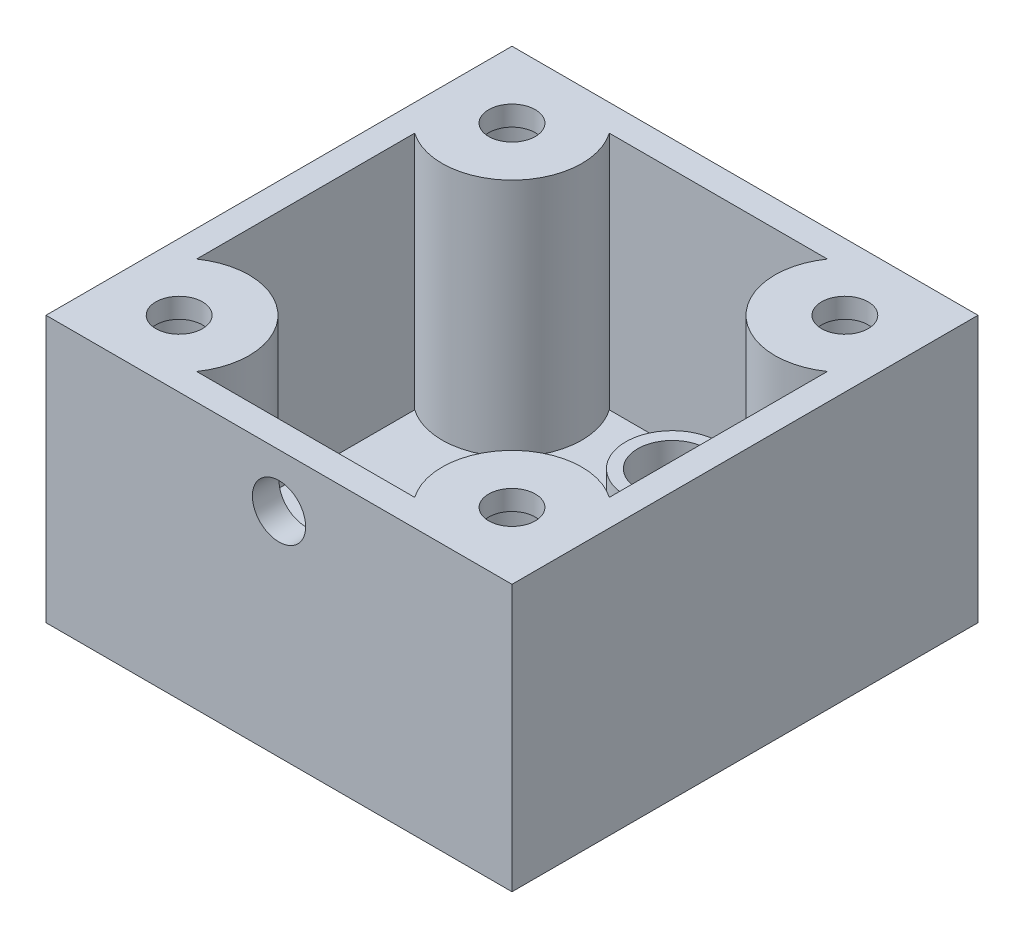
ISO-10303-21;
HEADER;
FILE_DESCRIPTION(('STEP AP214'),'2;1');
FILE_NAME('part.step','',(''),(''),'','','');
FILE_SCHEMA(('AUTOMOTIVE_DESIGN { 1 0 10303 214 1 1 1 1 }'));
ENDSEC;
DATA;
#1=APPLICATION_CONTEXT('core data for automotive mechanical design processes');
#2=APPLICATION_PROTOCOL_DEFINITION('international standard','automotive_design',2000,#1);
#3=PRODUCT_CONTEXT('',#1,'mechanical');
#4=PRODUCT('Part','Part','',(#3));
#5=PRODUCT_RELATED_PRODUCT_CATEGORY('part','',(#4));
#6=PRODUCT_DEFINITION_FORMATION('','',#4);
#7=PRODUCT_DEFINITION_CONTEXT('part definition',#1,'design');
#8=PRODUCT_DEFINITION('design','',#6,#7);
#9=PRODUCT_DEFINITION_SHAPE('','',#8);
#10=(LENGTH_UNIT() NAMED_UNIT(*) SI_UNIT(.MILLI.,.METRE.));
#11=(NAMED_UNIT(*) PLANE_ANGLE_UNIT() SI_UNIT($,.RADIAN.));
#12=(NAMED_UNIT(*) SI_UNIT($,.STERADIAN.) SOLID_ANGLE_UNIT());
#13=UNCERTAINTY_MEASURE_WITH_UNIT(LENGTH_MEASURE(1.E-05),#10,'distance_accuracy_value','');
#14=(GEOMETRIC_REPRESENTATION_CONTEXT(3) GLOBAL_UNCERTAINTY_ASSIGNED_CONTEXT((#13)) GLOBAL_UNIT_ASSIGNED_CONTEXT((#10,
#11,#12)) REPRESENTATION_CONTEXT('',''));
#15=CARTESIAN_POINT('',(0.,0.,0.));
#16=DIRECTION('',(0.,0.,1.));
#17=DIRECTION('',(1.,0.,0.));
#18=AXIS2_PLACEMENT_3D('',#15,#16,#17);
#19=CARTESIAN_POINT('',(-8.19157801509647,-63.8406204335661,-15.5));
#20=DIRECTION('',(0.,0.,-1.));
#21=DIRECTION('',(-1.,0.,0.));
#22=AXIS2_PLACEMENT_3D('',#19,#20,#21);
#23=PLANE('',#22);
#24=DIRECTION('',(0.,-1.,0.));
#25=VECTOR('',#24,1.);
#26=CARTESIAN_POINT('',(0.532816501638932,-16.,-15.5));
#27=LINE('',#26,#25);
#28=CARTESIAN_POINT('',(0.532816501638932,-18.,-15.5));
#29=VERTEX_POINT('',#28);
#30=CARTESIAN_POINT('',(0.532816501638932,-16.,-15.5));
#31=VERTEX_POINT('',#30);
#32=EDGE_CURVE('E12',#29,#31,#27,.F.);
#33=ORIENTED_EDGE('',*,*,#32,.F.);
#34=DIRECTION('',(-1.,0.,0.));
#35=VECTOR('',#34,1.);
#36=CARTESIAN_POINT('',(-8.19157801509647,-18.,-15.5));
#37=LINE('',#36,#35);
#38=CARTESIAN_POINT('',(8.19157801509653,-18.,-15.5));
#39=VERTEX_POINT('',#38);
#40=EDGE_CURVE('E228',#39,#29,#37,.T.);
#41=ORIENTED_EDGE('',*,*,#40,.F.);
#42=DIRECTION('',(0.,1.,0.));
#43=VECTOR('',#42,1.);
#44=CARTESIAN_POINT('',(8.19157801509653,-63.8406204335661,-15.5));
#45=LINE('',#44,#43);
#46=CARTESIAN_POINT('',(8.19157801509653,0.,-15.5));
#47=VERTEX_POINT('',#46);
#48=EDGE_CURVE('E235',#39,#47,#45,.T.);
#49=ORIENTED_EDGE('',*,*,#48,.T.);
#50=DIRECTION('',(-1.,0.,0.));
#51=VECTOR('',#50,1.);
#52=CARTESIAN_POINT('',(-8.19157801509647,0.,-15.5));
#53=LINE('',#52,#51);
#54=CARTESIAN_POINT('',(-8.19157801509647,0.,-15.5));
#55=VERTEX_POINT('',#54);
#56=EDGE_CURVE('E197',#47,#55,#53,.T.);
#57=ORIENTED_EDGE('',*,*,#56,.T.);
#58=DIRECTION('',(0.,1.,0.));
#59=VECTOR('',#58,1.);
#60=CARTESIAN_POINT('',(-8.19157801509647,-63.8406204335661,-15.5));
#61=LINE('',#60,#59);
#62=CARTESIAN_POINT('',(-8.19157801509647,-18.,-15.5));
#63=VERTEX_POINT('',#62);
#64=EDGE_CURVE('E227',#63,#55,#61,.T.);
#65=ORIENTED_EDGE('',*,*,#64,.F.);
#66=CARTESIAN_POINT('',(-0.532816501638932,-18.,-15.5));
#67=VERTEX_POINT('',#66);
#68=EDGE_CURVE('E231',#67,#63,#37,.T.);
#69=ORIENTED_EDGE('',*,*,#68,.F.);
#70=DIRECTION('',(0.,-1.,0.));
#71=VECTOR('',#70,1.);
#72=CARTESIAN_POINT('',(-0.532816501638932,-16.,-15.5));
#73=LINE('',#72,#71);
#74=CARTESIAN_POINT('',(-0.532816501638932,-16.,-15.5));
#75=VERTEX_POINT('',#74);
#76=EDGE_CURVE('E312',#75,#67,#73,.T.);
#77=ORIENTED_EDGE('',*,*,#76,.F.);
#78=DIRECTION('',(1.,0.,0.));
#79=VECTOR('',#78,1.);
#80=CARTESIAN_POINT('',(-8.19157801509647,-16.,-15.5));
#81=LINE('',#80,#79);
#82=EDGE_CURVE('E47',#75,#31,#81,.T.);
#83=ORIENTED_EDGE('',*,*,#82,.T.);
#84=EDGE_LOOP('',(#33,#41,#49,#57,#65,#69,#77,#83));
#85=FACE_BOUND('',#84,.T.);
#86=ADVANCED_FACE('F38',(#85),#23,.F.);
#87=CARTESIAN_POINT('',(0.,0.,0.));
#88=DIRECTION('',(0.,-1.,0.));
#89=DIRECTION('',(0.,0.,-1.));
#90=AXIS2_PLACEMENT_3D('',#87,#88,#89);
#91=PLANE('',#90);
#92=CARTESIAN_POINT('',(-12.4999999999993,0.,12.5));
#93=DIRECTION('',(0.,1.,0.));
#94=DIRECTION('',(0.,0.,1.));
#95=AXIS2_PLACEMENT_3D('',#92,#93,#94);
#96=CIRCLE('',#95,1.75000000000037);
#97=CARTESIAN_POINT('',(-12.4999999999993,0.,14.2500000000004));
#98=VERTEX_POINT('',#97);
#99=EDGE_CURVE('E181',#98,#98,#96,.T.);
#100=ORIENTED_EDGE('',*,*,#99,.F.);
#101=EDGE_LOOP('',(#100));
#102=FACE_BOUND('',#101,.T.);
#103=CARTESIAN_POINT('',(12.5000000000007,0.,12.4999999999993));
#104=DIRECTION('',(0.,1.,0.));
#105=DIRECTION('',(0.,0.,1.));
#106=AXIS2_PLACEMENT_3D('',#103,#104,#105);
#107=CIRCLE('',#106,1.750000000001);
#108=CARTESIAN_POINT('',(12.5000000000007,0.,14.2500000000003));
#109=VERTEX_POINT('',#108);
#110=EDGE_CURVE('E178',#109,#109,#107,.T.);
#111=ORIENTED_EDGE('',*,*,#110,.F.);
#112=EDGE_LOOP('',(#111));
#113=FACE_BOUND('',#112,.T.);
#114=CARTESIAN_POINT('',(12.5,0.,-12.5000000000007));
#115=DIRECTION('',(0.,1.,0.));
#116=DIRECTION('',(0.,0.,1.));
#117=AXIS2_PLACEMENT_3D('',#114,#115,#116);
#118=CIRCLE('',#117,1.75000000000073);
#119=CARTESIAN_POINT('',(12.5,0.,-10.75));
#120=VERTEX_POINT('',#119);
#121=EDGE_CURVE('E174',#120,#120,#118,.T.);
#122=ORIENTED_EDGE('',*,*,#121,.F.);
#123=EDGE_LOOP('',(#122));
#124=FACE_BOUND('',#123,.T.);
#125=CARTESIAN_POINT('',(-12.5,0.,-12.5));
#126=DIRECTION('',(0.,1.,0.));
#127=DIRECTION('',(0.,0.,1.));
#128=AXIS2_PLACEMENT_3D('',#125,#126,#127);
#129=CIRCLE('',#128,1.75);
#130=CARTESIAN_POINT('',(-12.5,0.,-10.75));
#131=VERTEX_POINT('',#130);
#132=EDGE_CURVE('E177',#131,#131,#129,.T.);
#133=ORIENTED_EDGE('',*,*,#132,.F.);
#134=EDGE_LOOP('',(#133));
#135=FACE_BOUND('',#134,.T.);
#136=DIRECTION('',(0.,0.,-1.));
#137=VECTOR('',#136,1.);
#138=CARTESIAN_POINT('',(17.5,0.,17.5));
#139=LINE('',#138,#137);
#140=CARTESIAN_POINT('',(17.5,0.,17.5));
#141=VERTEX_POINT('',#140);
#142=CARTESIAN_POINT('',(17.5,0.,-17.5));
#143=VERTEX_POINT('',#142);
#144=EDGE_CURVE('E283',#141,#143,#139,.T.);
#145=ORIENTED_EDGE('',*,*,#144,.T.);
#146=DIRECTION('',(-1.,0.,0.));
#147=VECTOR('',#146,1.);
#148=CARTESIAN_POINT('',(-17.5,0.,-17.5));
#149=LINE('',#148,#147);
#150=CARTESIAN_POINT('',(-17.5,0.,-17.5));
#151=VERTEX_POINT('',#150);
#152=EDGE_CURVE('E302',#143,#151,#149,.T.);
#153=ORIENTED_EDGE('',*,*,#152,.T.);
#154=DIRECTION('',(0.,0.,1.));
#155=VECTOR('',#154,1.);
#156=CARTESIAN_POINT('',(-17.5,0.,17.5));
#157=LINE('',#156,#155);
#158=CARTESIAN_POINT('',(-17.5,0.,17.5));
#159=VERTEX_POINT('',#158);
#160=EDGE_CURVE('E305',#151,#159,#157,.T.);
#161=ORIENTED_EDGE('',*,*,#160,.T.);
#162=DIRECTION('',(1.,0.,0.));
#163=VECTOR('',#162,1.);
#164=CARTESIAN_POINT('',(-17.5,0.,17.5));
#165=LINE('',#164,#163);
#166=EDGE_CURVE('E290',#159,#141,#165,.T.);
#167=ORIENTED_EDGE('',*,*,#166,.T.);
#168=EDGE_LOOP('',(#145,#153,#161,#167));
#169=FACE_BOUND('',#168,.T.);
#170=CARTESIAN_POINT('',(-12.5000000000001,0.,12.4999999999999));
#171=DIRECTION('',(0.,-1.,0.));
#172=DIRECTION('',(0.,0.,-1.));
#173=AXIS2_PLACEMENT_3D('',#170,#171,#172);
#174=CIRCLE('',#173,5.25);
#175=CARTESIAN_POINT('',(-15.5000000000001,0.,8.19157801509631));
#176=VERTEX_POINT('',#175);
#177=CARTESIAN_POINT('',(-8.19157801509664,0.,15.4999999999999));
#178=VERTEX_POINT('',#177);
#179=EDGE_CURVE('E212',#176,#178,#174,.T.);
#180=ORIENTED_EDGE('',*,*,#179,.F.);
#181=DIRECTION('',(0.,0.,1.));
#182=VECTOR('',#181,1.);
#183=CARTESIAN_POINT('',(-15.5000000000001,0.,8.19157801509631));
#184=LINE('',#183,#182);
#185=CARTESIAN_POINT('',(-15.5,0.,-8.19157801509648));
#186=VERTEX_POINT('',#185);
#187=EDGE_CURVE('E215',#186,#176,#184,.T.);
#188=ORIENTED_EDGE('',*,*,#187,.F.);
#189=CARTESIAN_POINT('',(-12.5,0.,-12.5));
#190=DIRECTION('',(0.,-1.,0.));
#191=DIRECTION('',(0.,0.,-1.));
#192=AXIS2_PLACEMENT_3D('',#189,#190,#191);
#193=CIRCLE('',#192,5.25);
#194=EDGE_CURVE('E194',#55,#186,#193,.T.);
#195=ORIENTED_EDGE('',*,*,#194,.F.);
#196=ORIENTED_EDGE('',*,*,#56,.F.);
#197=CARTESIAN_POINT('',(12.5,0.,-12.5));
#198=DIRECTION('',(0.,-1.,0.));
#199=DIRECTION('',(0.,0.,-1.));
#200=AXIS2_PLACEMENT_3D('',#197,#198,#199);
#201=CIRCLE('',#200,5.25);
#202=CARTESIAN_POINT('',(15.5,0.,-8.19157801509642));
#203=VERTEX_POINT('',#202);
#204=EDGE_CURVE('E200',#203,#47,#201,.T.);
#205=ORIENTED_EDGE('',*,*,#204,.F.);
#206=DIRECTION('',(0.,0.,-1.));
#207=VECTOR('',#206,1.);
#208=CARTESIAN_POINT('',(15.5,0.,-8.19157801509642));
#209=LINE('',#208,#207);
#210=CARTESIAN_POINT('',(15.4999999999999,0.,8.19157801509659));
#211=VERTEX_POINT('',#210);
#212=EDGE_CURVE('E203',#211,#203,#209,.T.);
#213=ORIENTED_EDGE('',*,*,#212,.F.);
#214=CARTESIAN_POINT('',(12.4999999999999,0.,12.5000000000001));
#215=DIRECTION('',(0.,-1.,0.));
#216=DIRECTION('',(0.,0.,-1.));
#217=AXIS2_PLACEMENT_3D('',#214,#215,#216);
#218=CIRCLE('',#217,5.25);
#219=CARTESIAN_POINT('',(8.19157801509637,0.,15.5000000000001));
#220=VERTEX_POINT('',#219);
#221=EDGE_CURVE('E206',#220,#211,#218,.T.);
#222=ORIENTED_EDGE('',*,*,#221,.F.);
#223=DIRECTION('',(1.,0.,0.));
#224=VECTOR('',#223,1.);
#225=CARTESIAN_POINT('',(8.19157801509636,0.,15.5000000000001));
#226=LINE('',#225,#224);
#227=EDGE_CURVE('E209',#178,#220,#226,.T.);
#228=ORIENTED_EDGE('',*,*,#227,.F.);
#229=EDGE_LOOP('',(#180,#188,#195,#196,#205,#213,#222,#228));
#230=FACE_BOUND('',#229,.T.);
#231=ADVANCED_FACE('F351',(#102,#113,#124,#135,#169,#230),#91,.F.);
#232=CARTESIAN_POINT('',(17.5,-20.,17.5));
#233=DIRECTION('',(1.,0.,0.));
#234=DIRECTION('',(0.,0.,-1.));
#235=AXIS2_PLACEMENT_3D('',#232,#233,#234);
#236=PLANE('',#235);
#237=ORIENTED_EDGE('',*,*,#144,.F.);
#238=DIRECTION('',(0.,1.,0.));
#239=VECTOR('',#238,1.);
#240=CARTESIAN_POINT('',(17.5,-20.,17.5));
#241=LINE('',#240,#239);
#242=CARTESIAN_POINT('',(17.5,-20.,17.5));
#243=VERTEX_POINT('',#242);
#244=EDGE_CURVE('E310',#243,#141,#241,.T.);
#245=ORIENTED_EDGE('',*,*,#244,.F.);
#246=DIRECTION('',(0.,0.,-1.));
#247=VECTOR('',#246,1.);
#248=CARTESIAN_POINT('',(17.5,-20.,17.5));
#249=LINE('',#248,#247);
#250=CARTESIAN_POINT('',(17.5,-20.,-17.5));
#251=VERTEX_POINT('',#250);
#252=EDGE_CURVE('E286',#243,#251,#249,.T.);
#253=ORIENTED_EDGE('',*,*,#252,.T.);
#254=DIRECTION('',(0.,1.,0.));
#255=VECTOR('',#254,1.);
#256=CARTESIAN_POINT('',(17.5,-20.,-17.5));
#257=LINE('',#256,#255);
#258=EDGE_CURVE('E299',#251,#143,#257,.T.);
#259=ORIENTED_EDGE('',*,*,#258,.T.);
#260=EDGE_LOOP('',(#237,#245,#253,#259));
#261=FACE_BOUND('',#260,.T.);
#262=ADVANCED_FACE('F40',(#261),#236,.T.);
#263=CARTESIAN_POINT('',(-17.5,-20.,17.5));
#264=DIRECTION('',(0.,0.,1.));
#265=DIRECTION('',(1.,0.,0.));
#266=AXIS2_PLACEMENT_3D('',#263,#264,#265);
#267=PLANE('',#266);
#268=CARTESIAN_POINT('',(0.,-4.,17.5));
#269=DIRECTION('',(0.,0.,1.));
#270=DIRECTION('',(1.,0.,0.));
#271=AXIS2_PLACEMENT_3D('',#268,#269,#270);
#272=CIRCLE('',#271,2.);
#273=CARTESIAN_POINT('',(2.,-4.,17.5));
#274=VERTEX_POINT('',#273);
#275=EDGE_CURVE('E670',#274,#274,#272,.T.);
#276=ORIENTED_EDGE('',*,*,#275,.F.);
#277=EDGE_LOOP('',(#276));
#278=FACE_BOUND('',#277,.T.);
#279=ORIENTED_EDGE('',*,*,#166,.F.);
#280=DIRECTION('',(0.,1.,0.));
#281=VECTOR('',#280,1.);
#282=CARTESIAN_POINT('',(-17.5,-20.,17.5));
#283=LINE('',#282,#281);
#284=CARTESIAN_POINT('',(-17.5,-20.,17.5));
#285=VERTEX_POINT('',#284);
#286=EDGE_CURVE('E313',#285,#159,#283,.T.);
#287=ORIENTED_EDGE('',*,*,#286,.F.);
#288=DIRECTION('',(1.,0.,0.));
#289=VECTOR('',#288,1.);
#290=CARTESIAN_POINT('',(-17.5,-20.,17.5));
#291=LINE('',#290,#289);
#292=EDGE_CURVE('E296',#285,#243,#291,.T.);
#293=ORIENTED_EDGE('',*,*,#292,.T.);
#294=ORIENTED_EDGE('',*,*,#244,.T.);
#295=EDGE_LOOP('',(#279,#287,#293,#294));
#296=FACE_BOUND('',#295,.T.);
#297=ADVANCED_FACE('F425',(#278,#296),#267,.T.);
#298=CARTESIAN_POINT('',(-17.5,-20.,17.5));
#299=DIRECTION('',(-1.,0.,0.));
#300=DIRECTION('',(0.,0.,1.));
#301=AXIS2_PLACEMENT_3D('',#298,#299,#300);
#302=PLANE('',#301);
#303=ORIENTED_EDGE('',*,*,#160,.F.);
#304=DIRECTION('',(0.,1.,0.));
#305=VECTOR('',#304,1.);
#306=CARTESIAN_POINT('',(-17.5,-20.,-17.5));
#307=LINE('',#306,#305);
#308=CARTESIAN_POINT('',(-17.5,-20.,-17.5));
#309=VERTEX_POINT('',#308);
#310=EDGE_CURVE('E315',#309,#151,#307,.T.);
#311=ORIENTED_EDGE('',*,*,#310,.F.);
#312=DIRECTION('',(0.,0.,1.));
#313=VECTOR('',#312,1.);
#314=CARTESIAN_POINT('',(-17.5,-20.,17.5));
#315=LINE('',#314,#313);
#316=EDGE_CURVE('E293',#309,#285,#315,.T.);
#317=ORIENTED_EDGE('',*,*,#316,.T.);
#318=ORIENTED_EDGE('',*,*,#286,.T.);
#319=EDGE_LOOP('',(#303,#311,#317,#318));
#320=FACE_BOUND('',#319,.T.);
#321=ADVANCED_FACE('F428',(#320),#302,.T.);
#322=CARTESIAN_POINT('',(-17.5,-20.,-17.5));
#323=DIRECTION('',(0.,0.,-1.));
#324=DIRECTION('',(-1.,0.,0.));
#325=AXIS2_PLACEMENT_3D('',#322,#323,#324);
#326=PLANE('',#325);
#327=ORIENTED_EDGE('',*,*,#152,.F.);
#328=ORIENTED_EDGE('',*,*,#258,.F.);
#329=DIRECTION('',(-1.,0.,0.));
#330=VECTOR('',#329,1.);
#331=CARTESIAN_POINT('',(-17.5,-20.,-17.5));
#332=LINE('',#331,#330);
#333=EDGE_CURVE('E289',#251,#309,#332,.T.);
#334=ORIENTED_EDGE('',*,*,#333,.T.);
#335=ORIENTED_EDGE('',*,*,#310,.T.);
#336=EDGE_LOOP('',(#327,#328,#334,#335));
#337=FACE_BOUND('',#336,.T.);
#338=ADVANCED_FACE('F422',(#337),#326,.T.);
#339=CARTESIAN_POINT('',(0.,-20.,0.));
#340=DIRECTION('',(0.,-1.,0.));
#341=DIRECTION('',(0.,0.,-1.));
#342=AXIS2_PLACEMENT_3D('',#339,#340,#341);
#343=PLANE('',#342);
#344=CARTESIAN_POINT('',(0.,-20.,-12.0407939385487));
#345=DIRECTION('',(0.,1.,0.));
#346=DIRECTION('',(0.,0.,1.));
#347=AXIS2_PLACEMENT_3D('',#344,#345,#346);
#348=CIRCLE('',#347,2.6);
#349=CARTESIAN_POINT('',(0.,-20.,-9.44079393854873));
#350=VERTEX_POINT('',#349);
#351=EDGE_CURVE('E168',#350,#350,#348,.T.);
#352=ORIENTED_EDGE('',*,*,#351,.T.);
#353=EDGE_LOOP('',(#352));
#354=FACE_BOUND('',#353,.T.);
#355=CARTESIAN_POINT('',(0.,-20.,4.5));
#356=DIRECTION('',(0.,1.,0.));
#357=DIRECTION('',(0.,0.,1.));
#358=AXIS2_PLACEMENT_3D('',#355,#356,#357);
#359=CIRCLE('',#358,6.9);
#360=CARTESIAN_POINT('',(6.4,-20.,1.92124060835447));
#361=VERTEX_POINT('',#360);
#362=CARTESIAN_POINT('',(6.4,-20.,7.07875939164553));
#363=VERTEX_POINT('',#362);
#364=EDGE_CURVE('E55',#361,#363,#359,.T.);
#365=ORIENTED_EDGE('',*,*,#364,.T.);
#366=DIRECTION('',(0.,0.,-1.));
#367=VECTOR('',#366,1.);
#368=CARTESIAN_POINT('',(6.4,-20.,1.92124060835447));
#369=LINE('',#368,#367);
#370=EDGE_CURVE('E156',#363,#361,#369,.T.);
#371=ORIENTED_EDGE('',*,*,#370,.T.);
#372=EDGE_LOOP('',(#365,#371));
#373=FACE_BOUND('',#372,.T.);
#374=CARTESIAN_POINT('',(-12.5,-20.,12.5));
#375=DIRECTION('',(0.,1.,0.));
#376=DIRECTION('',(0.,0.,1.));
#377=AXIS2_PLACEMENT_3D('',#374,#375,#376);
#378=CIRCLE('',#377,3.25);
#379=CARTESIAN_POINT('',(-12.5,-20.,15.75));
#380=VERTEX_POINT('',#379);
#381=EDGE_CURVE('E268',#380,#380,#378,.T.);
#382=ORIENTED_EDGE('',*,*,#381,.T.);
#383=EDGE_LOOP('',(#382));
#384=FACE_BOUND('',#383,.T.);
#385=CARTESIAN_POINT('',(12.5,-20.,-12.5));
#386=DIRECTION('',(0.,1.,0.));
#387=DIRECTION('',(0.,0.,1.));
#388=AXIS2_PLACEMENT_3D('',#385,#386,#387);
#389=CIRCLE('',#388,3.25);
#390=CARTESIAN_POINT('',(12.5,-20.,-9.25));
#391=VERTEX_POINT('',#390);
#392=EDGE_CURVE('E275',#391,#391,#389,.T.);
#393=ORIENTED_EDGE('',*,*,#392,.T.);
#394=EDGE_LOOP('',(#393));
#395=FACE_BOUND('',#394,.T.);
#396=CARTESIAN_POINT('',(12.5,-20.,12.5));
#397=DIRECTION('',(0.,1.,0.));
#398=DIRECTION('',(0.,0.,1.));
#399=AXIS2_PLACEMENT_3D('',#396,#397,#398);
#400=CIRCLE('',#399,3.25);
#401=CARTESIAN_POINT('',(12.5,-20.,15.75));
#402=VERTEX_POINT('',#401);
#403=EDGE_CURVE('E262',#402,#402,#400,.T.);
#404=ORIENTED_EDGE('',*,*,#403,.T.);
#405=EDGE_LOOP('',(#404));
#406=FACE_BOUND('',#405,.T.);
#407=CARTESIAN_POINT('',(-12.5,-20.,-12.5));
#408=DIRECTION('',(0.,1.,0.));
#409=DIRECTION('',(0.,0.,1.));
#410=AXIS2_PLACEMENT_3D('',#407,#408,#409);
#411=CIRCLE('',#410,3.25);
#412=CARTESIAN_POINT('',(-12.5,-20.,-9.25));
#413=VERTEX_POINT('',#412);
#414=EDGE_CURVE('E280',#413,#413,#411,.T.);
#415=ORIENTED_EDGE('',*,*,#414,.T.);
#416=EDGE_LOOP('',(#415));
#417=FACE_BOUND('',#416,.T.);
#418=ORIENTED_EDGE('',*,*,#252,.F.);
#419=ORIENTED_EDGE('',*,*,#292,.F.);
#420=ORIENTED_EDGE('',*,*,#316,.F.);
#421=ORIENTED_EDGE('',*,*,#333,.F.);
#422=EDGE_LOOP('',(#418,#419,#420,#421));
#423=FACE_BOUND('',#422,.T.);
#424=ADVANCED_FACE('F162',(#354,#373,#384,#395,#406,#417,#423),#343,.T.);
#425=CARTESIAN_POINT('',(-12.5,-20.,-12.5));
#426=DIRECTION('',(0.,1.,0.));
#427=DIRECTION('',(0.,0.,1.));
#428=AXIS2_PLACEMENT_3D('',#425,#426,#427);
#429=CYLINDRICAL_SURFACE('',#428,3.25);
#430=ORIENTED_EDGE('',*,*,#414,.F.);
#431=EDGE_LOOP('',(#430));
#432=FACE_BOUND('',#431,.T.);
#433=CARTESIAN_POINT('',(-12.5,-1.5,-12.5));
#434=DIRECTION('',(0.,1.,0.));
#435=DIRECTION('',(0.,0.,1.));
#436=AXIS2_PLACEMENT_3D('',#433,#434,#435);
#437=CIRCLE('',#436,3.25);
#438=CARTESIAN_POINT('',(-12.5,-1.5,-9.25));
#439=VERTEX_POINT('',#438);
#440=EDGE_CURVE('E271',#439,#439,#437,.T.);
#441=ORIENTED_EDGE('',*,*,#440,.T.);
#442=EDGE_LOOP('',(#441));
#443=FACE_BOUND('',#442,.T.);
#444=ADVANCED_FACE('F418',(#432,#443),#429,.F.);
#445=CARTESIAN_POINT('',(-12.5,-1.5,-12.5));
#446=DIRECTION('',(0.,1.,0.));
#447=DIRECTION('',(0.,0.,1.));
#448=AXIS2_PLACEMENT_3D('',#445,#446,#447);
#449=PLANE('',#448);
#450=CARTESIAN_POINT('',(-12.5,-1.5,-12.5));
#451=DIRECTION('',(0.,1.,0.));
#452=DIRECTION('',(0.,0.,1.));
#453=AXIS2_PLACEMENT_3D('',#450,#451,#452);
#454=CIRCLE('',#453,1.75);
#455=CARTESIAN_POINT('',(-12.5,-1.5,-10.75));
#456=VERTEX_POINT('',#455);
#457=EDGE_CURVE('E42',#456,#456,#454,.T.);
#458=ORIENTED_EDGE('',*,*,#457,.T.);
#459=EDGE_LOOP('',(#458));
#460=FACE_BOUND('',#459,.T.);
#461=ORIENTED_EDGE('',*,*,#440,.F.);
#462=EDGE_LOOP('',(#461));
#463=FACE_BOUND('',#462,.T.);
#464=ADVANCED_FACE('F332',(#460,#463),#449,.F.);
#465=CARTESIAN_POINT('',(12.5,-20.,12.5));
#466=DIRECTION('',(0.,1.,0.));
#467=DIRECTION('',(0.,0.,1.));
#468=AXIS2_PLACEMENT_3D('',#465,#466,#467);
#469=CYLINDRICAL_SURFACE('',#468,3.25);
#470=ORIENTED_EDGE('',*,*,#403,.F.);
#471=EDGE_LOOP('',(#470));
#472=FACE_BOUND('',#471,.T.);
#473=CARTESIAN_POINT('',(12.5,-1.5,12.5));
#474=DIRECTION('',(0.,1.,0.));
#475=DIRECTION('',(0.,0.,1.));
#476=AXIS2_PLACEMENT_3D('',#473,#474,#475);
#477=CIRCLE('',#476,3.25);
#478=CARTESIAN_POINT('',(12.5,-1.5,15.75));
#479=VERTEX_POINT('',#478);
#480=EDGE_CURVE('E261',#479,#479,#477,.T.);
#481=ORIENTED_EDGE('',*,*,#480,.T.);
#482=EDGE_LOOP('',(#481));
#483=FACE_BOUND('',#482,.T.);
#484=ADVANCED_FACE('F398',(#472,#483),#469,.F.);
#485=CARTESIAN_POINT('',(12.5,-1.5,12.5));
#486=DIRECTION('',(0.,1.,0.));
#487=DIRECTION('',(0.,0.,1.));
#488=AXIS2_PLACEMENT_3D('',#485,#486,#487);
#489=PLANE('',#488);
#490=CARTESIAN_POINT('',(12.5000000000007,-1.5,12.4999999999993));
#491=DIRECTION('',(0.,1.,0.));
#492=DIRECTION('',(0.,0.,1.));
#493=AXIS2_PLACEMENT_3D('',#490,#491,#492);
#494=CIRCLE('',#493,1.750000000001);
#495=CARTESIAN_POINT('',(12.5000000000007,-1.5,14.2500000000003));
#496=VERTEX_POINT('',#495);
#497=EDGE_CURVE('E325',#496,#496,#494,.T.);
#498=ORIENTED_EDGE('',*,*,#497,.T.);
#499=EDGE_LOOP('',(#498));
#500=FACE_BOUND('',#499,.T.);
#501=ORIENTED_EDGE('',*,*,#480,.F.);
#502=EDGE_LOOP('',(#501));
#503=FACE_BOUND('',#502,.T.);
#504=ADVANCED_FACE('F394',(#500,#503),#489,.F.);
#505=CARTESIAN_POINT('',(12.5,-20.,-12.5));
#506=DIRECTION('',(0.,1.,0.));
#507=DIRECTION('',(0.,0.,1.));
#508=AXIS2_PLACEMENT_3D('',#505,#506,#507);
#509=CYLINDRICAL_SURFACE('',#508,3.25);
#510=ORIENTED_EDGE('',*,*,#392,.F.);
#511=EDGE_LOOP('',(#510));
#512=FACE_BOUND('',#511,.T.);
#513=CARTESIAN_POINT('',(12.5,-1.5,-12.5));
#514=DIRECTION('',(0.,1.,0.));
#515=DIRECTION('',(0.,0.,1.));
#516=AXIS2_PLACEMENT_3D('',#513,#514,#515);
#517=CIRCLE('',#516,3.25);
#518=CARTESIAN_POINT('',(12.5,-1.5,-9.25));
#519=VERTEX_POINT('',#518);
#520=EDGE_CURVE('E265',#519,#519,#517,.T.);
#521=ORIENTED_EDGE('',*,*,#520,.T.);
#522=EDGE_LOOP('',(#521));
#523=FACE_BOUND('',#522,.T.);
#524=ADVANCED_FACE('F397',(#512,#523),#509,.F.);
#525=CARTESIAN_POINT('',(12.5,-1.5,-12.5));
#526=DIRECTION('',(0.,1.,0.));
#527=DIRECTION('',(0.,0.,1.));
#528=AXIS2_PLACEMENT_3D('',#525,#526,#527);
#529=PLANE('',#528);
#530=CARTESIAN_POINT('',(12.5,-1.5,-12.5000000000007));
#531=DIRECTION('',(0.,1.,0.));
#532=DIRECTION('',(0.,0.,1.));
#533=AXIS2_PLACEMENT_3D('',#530,#531,#532);
#534=CIRCLE('',#533,1.75000000000073);
#535=CARTESIAN_POINT('',(12.5,-1.5,-10.75));
#536=VERTEX_POINT('',#535);
#537=EDGE_CURVE('E323',#536,#536,#534,.T.);
#538=ORIENTED_EDGE('',*,*,#537,.T.);
#539=EDGE_LOOP('',(#538));
#540=FACE_BOUND('',#539,.T.);
#541=ORIENTED_EDGE('',*,*,#520,.F.);
#542=EDGE_LOOP('',(#541));
#543=FACE_BOUND('',#542,.T.);
#544=ADVANCED_FACE('F408',(#540,#543),#529,.F.);
#545=CARTESIAN_POINT('',(-12.5,-20.,12.5));
#546=DIRECTION('',(0.,1.,0.));
#547=DIRECTION('',(0.,0.,1.));
#548=AXIS2_PLACEMENT_3D('',#545,#546,#547);
#549=CYLINDRICAL_SURFACE('',#548,3.25);
#550=ORIENTED_EDGE('',*,*,#381,.F.);
#551=EDGE_LOOP('',(#550));
#552=FACE_BOUND('',#551,.T.);
#553=CARTESIAN_POINT('',(-12.5,-1.5,12.5));
#554=DIRECTION('',(0.,1.,0.));
#555=DIRECTION('',(0.,0.,1.));
#556=AXIS2_PLACEMENT_3D('',#553,#554,#555);
#557=CIRCLE('',#556,3.25);
#558=CARTESIAN_POINT('',(-12.5,-1.5,15.75));
#559=VERTEX_POINT('',#558);
#560=EDGE_CURVE('E272',#559,#559,#557,.T.);
#561=ORIENTED_EDGE('',*,*,#560,.T.);
#562=EDGE_LOOP('',(#561));
#563=FACE_BOUND('',#562,.T.);
#564=ADVANCED_FACE('F404',(#552,#563),#549,.F.);
#565=CARTESIAN_POINT('',(-12.5,-1.5,12.5));
#566=DIRECTION('',(0.,1.,0.));
#567=DIRECTION('',(0.,0.,1.));
#568=AXIS2_PLACEMENT_3D('',#565,#566,#567);
#569=PLANE('',#568);
#570=CARTESIAN_POINT('',(-12.4999999999993,-1.5,12.5));
#571=DIRECTION('',(0.,1.,0.));
#572=DIRECTION('',(0.,0.,1.));
#573=AXIS2_PLACEMENT_3D('',#570,#571,#572);
#574=CIRCLE('',#573,1.75000000000037);
#575=CARTESIAN_POINT('',(-12.4999999999993,-1.5,14.2500000000004));
#576=VERTEX_POINT('',#575);
#577=EDGE_CURVE('E186',#576,#576,#574,.T.);
#578=ORIENTED_EDGE('',*,*,#577,.T.);
#579=EDGE_LOOP('',(#578));
#580=FACE_BOUND('',#579,.T.);
#581=ORIENTED_EDGE('',*,*,#560,.F.);
#582=EDGE_LOOP('',(#581));
#583=FACE_BOUND('',#582,.T.);
#584=ADVANCED_FACE('F392',(#580,#583),#569,.F.);
#585=CARTESIAN_POINT('',(0.,-18.,0.));
#586=DIRECTION('',(0.,-1.,0.));
#587=DIRECTION('',(0.,0.,-1.));
#588=AXIS2_PLACEMENT_3D('',#585,#586,#587);
#589=PLANE('',#588);
#590=DIRECTION('',(0.,0.,-1.));
#591=VECTOR('',#590,1.);
#592=CARTESIAN_POINT('',(6.4,-18.,1.92124060835447));
#593=LINE('',#592,#591);
#594=CARTESIAN_POINT('',(6.4,-18.,7.07875939164553));
#595=VERTEX_POINT('',#594);
#596=CARTESIAN_POINT('',(6.4,-18.,1.92124060835447));
#597=VERTEX_POINT('',#596);
#598=EDGE_CURVE('E164',#595,#597,#593,.T.);
#599=ORIENTED_EDGE('',*,*,#598,.F.);
#600=CARTESIAN_POINT('',(0.,-18.,4.5));
#601=DIRECTION('',(0.,1.,0.));
#602=DIRECTION('',(0.,0.,1.));
#603=AXIS2_PLACEMENT_3D('',#600,#601,#602);
#604=CIRCLE('',#603,6.9);
#605=EDGE_CURVE('E60',#597,#595,#604,.T.);
#606=ORIENTED_EDGE('',*,*,#605,.F.);
#607=EDGE_LOOP('',(#599,#606));
#608=FACE_BOUND('',#607,.T.);
#609=CARTESIAN_POINT('',(0.,-18.,-12.0407939385487));
#610=DIRECTION('',(0.,1.,0.));
#611=DIRECTION('',(0.,0.,1.));
#612=AXIS2_PLACEMENT_3D('',#609,#610,#611);
#613=CIRCLE('',#612,3.5);
#614=EDGE_CURVE('E190',#67,#29,#613,.T.);
#615=ORIENTED_EDGE('',*,*,#614,.F.);
#616=ORIENTED_EDGE('',*,*,#68,.T.);
#617=CARTESIAN_POINT('',(-12.5,-18.,-12.5));
#618=DIRECTION('',(0.,-1.,0.));
#619=DIRECTION('',(0.,0.,-1.));
#620=AXIS2_PLACEMENT_3D('',#617,#618,#619);
#621=CIRCLE('',#620,5.25);
#622=CARTESIAN_POINT('',(-15.4999999999999,-18.,-8.19157801509648));
#623=VERTEX_POINT('',#622);
#624=EDGE_CURVE('E223',#63,#623,#621,.T.);
#625=ORIENTED_EDGE('',*,*,#624,.T.);
#626=DIRECTION('',(0.,0.,1.));
#627=VECTOR('',#626,1.);
#628=CARTESIAN_POINT('',(-15.5000000000001,-18.,8.19157801509631));
#629=LINE('',#628,#627);
#630=CARTESIAN_POINT('',(-15.5000000000001,-18.,8.19157801509631));
#631=VERTEX_POINT('',#630);
#632=EDGE_CURVE('E199',#623,#631,#629,.T.);
#633=ORIENTED_EDGE('',*,*,#632,.T.);
#634=CARTESIAN_POINT('',(-12.5000000000001,-18.,12.4999999999999));
#635=DIRECTION('',(0.,-1.,0.));
#636=DIRECTION('',(0.,0.,-1.));
#637=AXIS2_PLACEMENT_3D('',#634,#635,#636);
#638=CIRCLE('',#637,5.25);
#639=CARTESIAN_POINT('',(-8.19157801509664,-18.,15.4999999999999));
#640=VERTEX_POINT('',#639);
#641=EDGE_CURVE('E249',#631,#640,#638,.T.);
#642=ORIENTED_EDGE('',*,*,#641,.T.);
#643=DIRECTION('',(1.,0.,0.));
#644=VECTOR('',#643,1.);
#645=CARTESIAN_POINT('',(8.19157801509636,-18.,15.5000000000001));
#646=LINE('',#645,#644);
#647=CARTESIAN_POINT('',(8.19157801509637,-18.,15.5000000000001));
#648=VERTEX_POINT('',#647);
#649=EDGE_CURVE('E245',#640,#648,#646,.T.);
#650=ORIENTED_EDGE('',*,*,#649,.T.);
#651=CARTESIAN_POINT('',(12.4999999999999,-18.,12.5000000000001));
#652=DIRECTION('',(0.,-1.,0.));
#653=DIRECTION('',(0.,0.,-1.));
#654=AXIS2_PLACEMENT_3D('',#651,#652,#653);
#655=CIRCLE('',#654,5.25);
#656=CARTESIAN_POINT('',(15.4999999999999,-18.,8.19157801509659));
#657=VERTEX_POINT('',#656);
#658=EDGE_CURVE('E241',#648,#657,#655,.T.);
#659=ORIENTED_EDGE('',*,*,#658,.T.);
#660=DIRECTION('',(0.,0.,-1.));
#661=VECTOR('',#660,1.);
#662=CARTESIAN_POINT('',(15.5,-18.,-8.19157801509642));
#663=LINE('',#662,#661);
#664=CARTESIAN_POINT('',(15.5,-18.,-8.19157801509642));
#665=VERTEX_POINT('',#664);
#666=EDGE_CURVE('E237',#657,#665,#663,.T.);
#667=ORIENTED_EDGE('',*,*,#666,.T.);
#668=CARTESIAN_POINT('',(12.5,-18.,-12.5));
#669=DIRECTION('',(0.,-1.,0.));
#670=DIRECTION('',(0.,0.,-1.));
#671=AXIS2_PLACEMENT_3D('',#668,#669,#670);
#672=CIRCLE('',#671,5.25);
#673=EDGE_CURVE('E232',#665,#39,#672,.T.);
#674=ORIENTED_EDGE('',*,*,#673,.T.);
#675=ORIENTED_EDGE('',*,*,#40,.T.);
#676=EDGE_LOOP('',(#615,#616,#625,#633,#642,#650,#659,#667,#674,#675));
#677=FACE_BOUND('',#676,.T.);
#678=ADVANCED_FACE('F388',(#608,#677),#589,.F.);
#679=CARTESIAN_POINT('',(-15.5000000000001,-63.8406204335661,8.19157801509631));
#680=DIRECTION('',(-1.,0.,0.));
#681=DIRECTION('',(0.,0.,1.));
#682=AXIS2_PLACEMENT_3D('',#679,#680,#681);
#683=PLANE('',#682);
#684=DIRECTION('',(0.,1.,0.));
#685=VECTOR('',#684,1.);
#686=CARTESIAN_POINT('',(-15.5,-63.8406204335661,-8.19157801509648));
#687=LINE('',#686,#685);
#688=EDGE_CURVE('E226',#623,#186,#687,.T.);
#689=ORIENTED_EDGE('',*,*,#688,.T.);
#690=ORIENTED_EDGE('',*,*,#187,.T.);
#691=DIRECTION('',(0.,1.,0.));
#692=VECTOR('',#691,1.);
#693=CARTESIAN_POINT('',(-15.5000000000001,-63.8406204335661,8.19157801509631));
#694=LINE('',#693,#692);
#695=EDGE_CURVE('E222',#631,#176,#694,.T.);
#696=ORIENTED_EDGE('',*,*,#695,.F.);
#697=ORIENTED_EDGE('',*,*,#632,.F.);
#698=EDGE_LOOP('',(#689,#690,#696,#697));
#699=FACE_BOUND('',#698,.T.);
#700=ADVANCED_FACE('F384',(#699),#683,.F.);
#701=CARTESIAN_POINT('',(-12.5000000000001,-63.8406204335661,12.4999999999999));
#702=DIRECTION('',(0.,1.,0.));
#703=DIRECTION('',(0.,0.,1.));
#704=AXIS2_PLACEMENT_3D('',#701,#702,#703);
#705=CYLINDRICAL_SURFACE('',#704,5.25);
#706=ORIENTED_EDGE('',*,*,#695,.T.);
#707=ORIENTED_EDGE('',*,*,#179,.T.);
#708=DIRECTION('',(0.,1.,0.));
#709=VECTOR('',#708,1.);
#710=CARTESIAN_POINT('',(-8.19157801509664,-63.8406204335661,15.4999999999999));
#711=LINE('',#710,#709);
#712=EDGE_CURVE('E248',#640,#178,#711,.T.);
#713=ORIENTED_EDGE('',*,*,#712,.F.);
#714=ORIENTED_EDGE('',*,*,#641,.F.);
#715=EDGE_LOOP('',(#706,#707,#713,#714));
#716=FACE_BOUND('',#715,.T.);
#717=ADVANCED_FACE('F380',(#716),#705,.T.);
#718=CARTESIAN_POINT('',(8.19157801509636,-63.8406204335661,15.5000000000001));
#719=DIRECTION('',(0.,0.,1.));
#720=DIRECTION('',(1.,0.,0.));
#721=AXIS2_PLACEMENT_3D('',#718,#719,#720);
#722=PLANE('',#721);
#723=CARTESIAN_POINT('',(0.,-4.,15.5));
#724=DIRECTION('',(0.,0.,1.));
#725=DIRECTION('',(1.,0.,0.));
#726=AXIS2_PLACEMENT_3D('',#723,#724,#725);
#727=CIRCLE('',#726,2.);
#728=CARTESIAN_POINT('',(2.,-4.,15.5));
#729=VERTEX_POINT('',#728);
#730=EDGE_CURVE('E171',#729,#729,#727,.F.);
#731=ORIENTED_EDGE('',*,*,#730,.F.);
#732=EDGE_LOOP('',(#731));
#733=FACE_BOUND('',#732,.T.);
#734=ORIENTED_EDGE('',*,*,#712,.T.);
#735=ORIENTED_EDGE('',*,*,#227,.T.);
#736=DIRECTION('',(0.,1.,0.));
#737=VECTOR('',#736,1.);
#738=CARTESIAN_POINT('',(8.19157801509637,-63.8406204335661,15.5000000000001));
#739=LINE('',#738,#737);
#740=EDGE_CURVE('E244',#648,#220,#739,.T.);
#741=ORIENTED_EDGE('',*,*,#740,.F.);
#742=ORIENTED_EDGE('',*,*,#649,.F.);
#743=EDGE_LOOP('',(#734,#735,#741,#742));
#744=FACE_BOUND('',#743,.T.);
#745=ADVANCED_FACE('F376',(#733,#744),#722,.F.);
#746=CARTESIAN_POINT('',(12.4999999999999,-63.8406204335661,12.5000000000001));
#747=DIRECTION('',(0.,1.,0.));
#748=DIRECTION('',(0.,0.,1.));
#749=AXIS2_PLACEMENT_3D('',#746,#747,#748);
#750=CYLINDRICAL_SURFACE('',#749,5.25);
#751=ORIENTED_EDGE('',*,*,#740,.T.);
#752=ORIENTED_EDGE('',*,*,#221,.T.);
#753=DIRECTION('',(0.,1.,0.));
#754=VECTOR('',#753,1.);
#755=CARTESIAN_POINT('',(15.4999999999999,-63.8406204335661,8.19157801509659));
#756=LINE('',#755,#754);
#757=EDGE_CURVE('E240',#657,#211,#756,.T.);
#758=ORIENTED_EDGE('',*,*,#757,.F.);
#759=ORIENTED_EDGE('',*,*,#658,.F.);
#760=EDGE_LOOP('',(#751,#752,#758,#759));
#761=FACE_BOUND('',#760,.T.);
#762=ADVANCED_FACE('F372',(#761),#750,.T.);
#763=CARTESIAN_POINT('',(15.5,-63.8406204335661,-8.19157801509642));
#764=DIRECTION('',(1.,0.,0.));
#765=DIRECTION('',(0.,0.,-1.));
#766=AXIS2_PLACEMENT_3D('',#763,#764,#765);
#767=PLANE('',#766);
#768=ORIENTED_EDGE('',*,*,#757,.T.);
#769=ORIENTED_EDGE('',*,*,#212,.T.);
#770=DIRECTION('',(0.,1.,0.));
#771=VECTOR('',#770,1.);
#772=CARTESIAN_POINT('',(15.5,-63.8406204335661,-8.19157801509642));
#773=LINE('',#772,#771);
#774=EDGE_CURVE('E236',#665,#203,#773,.T.);
#775=ORIENTED_EDGE('',*,*,#774,.F.);
#776=ORIENTED_EDGE('',*,*,#666,.F.);
#777=EDGE_LOOP('',(#768,#769,#775,#776));
#778=FACE_BOUND('',#777,.T.);
#779=ADVANCED_FACE('F368',(#778),#767,.F.);
#780=CARTESIAN_POINT('',(12.5,-63.8406204335661,-12.5));
#781=DIRECTION('',(0.,1.,0.));
#782=DIRECTION('',(0.,0.,1.));
#783=AXIS2_PLACEMENT_3D('',#780,#781,#782);
#784=CYLINDRICAL_SURFACE('',#783,5.25);
#785=ORIENTED_EDGE('',*,*,#774,.T.);
#786=ORIENTED_EDGE('',*,*,#204,.T.);
#787=ORIENTED_EDGE('',*,*,#48,.F.);
#788=ORIENTED_EDGE('',*,*,#673,.F.);
#789=EDGE_LOOP('',(#785,#786,#787,#788));
#790=FACE_BOUND('',#789,.T.);
#791=ADVANCED_FACE('F365',(#790),#784,.T.);
#792=CARTESIAN_POINT('',(-12.5,-63.8406204335661,-12.5));
#793=DIRECTION('',(0.,1.,0.));
#794=DIRECTION('',(0.,0.,1.));
#795=AXIS2_PLACEMENT_3D('',#792,#793,#794);
#796=CYLINDRICAL_SURFACE('',#795,5.25);
#797=ORIENTED_EDGE('',*,*,#64,.T.);
#798=ORIENTED_EDGE('',*,*,#194,.T.);
#799=ORIENTED_EDGE('',*,*,#688,.F.);
#800=ORIENTED_EDGE('',*,*,#624,.F.);
#801=EDGE_LOOP('',(#797,#798,#799,#800));
#802=FACE_BOUND('',#801,.T.);
#803=ADVANCED_FACE('F363',(#802),#796,.T.);
#804=CARTESIAN_POINT('',(0.,-16.,-12.0407939385487));
#805=DIRECTION('',(0.,1.,0.));
#806=DIRECTION('',(0.,0.,1.));
#807=AXIS2_PLACEMENT_3D('',#804,#805,#806);
#808=PLANE('',#807);
#809=CARTESIAN_POINT('',(0.,-16.,-12.0407939385487));
#810=DIRECTION('',(0.,1.,0.));
#811=DIRECTION('',(0.,0.,1.));
#812=AXIS2_PLACEMENT_3D('',#809,#810,#811);
#813=CIRCLE('',#812,2.6);
#814=CARTESIAN_POINT('',(0.,-16.,-9.44079393854873));
#815=VERTEX_POINT('',#814);
#816=EDGE_CURVE('E187',#815,#815,#813,.T.);
#817=ORIENTED_EDGE('',*,*,#816,.F.);
#818=EDGE_LOOP('',(#817));
#819=FACE_BOUND('',#818,.T.);
#820=ORIENTED_EDGE('',*,*,#82,.F.);
#821=CARTESIAN_POINT('',(0.,-16.,-12.0407939385487));
#822=DIRECTION('',(0.,1.,0.));
#823=DIRECTION('',(0.,0.,1.));
#824=AXIS2_PLACEMENT_3D('',#821,#822,#823);
#825=CIRCLE('',#824,3.5);
#826=EDGE_CURVE('E191',#75,#31,#825,.T.);
#827=ORIENTED_EDGE('',*,*,#826,.T.);
#828=EDGE_LOOP('',(#820,#827));
#829=FACE_BOUND('',#828,.T.);
#830=ADVANCED_FACE('F540',(#819,#829),#808,.T.);
#831=CARTESIAN_POINT('',(0.,-16.,-12.0407939385487));
#832=DIRECTION('',(0.,-1.,0.));
#833=DIRECTION('',(0.,0.,-1.));
#834=AXIS2_PLACEMENT_3D('',#831,#832,#833);
#835=CYLINDRICAL_SURFACE('',#834,3.5);
#836=ORIENTED_EDGE('',*,*,#614,.T.);
#837=ORIENTED_EDGE('',*,*,#32,.T.);
#838=ORIENTED_EDGE('',*,*,#826,.F.);
#839=ORIENTED_EDGE('',*,*,#76,.T.);
#840=EDGE_LOOP('',(#836,#837,#838,#839));
#841=FACE_BOUND('',#840,.T.);
#842=ADVANCED_FACE('F555',(#841),#835,.T.);
#843=CARTESIAN_POINT('',(0.,-16.,-12.0407939385487));
#844=DIRECTION('',(0.,-1.,0.));
#845=DIRECTION('',(0.,0.,-1.));
#846=AXIS2_PLACEMENT_3D('',#843,#844,#845);
#847=CYLINDRICAL_SURFACE('',#846,2.6);
#848=ORIENTED_EDGE('',*,*,#816,.T.);
#849=EDGE_LOOP('',(#848));
#850=FACE_BOUND('',#849,.T.);
#851=ORIENTED_EDGE('',*,*,#351,.F.);
#852=EDGE_LOOP('',(#851));
#853=FACE_BOUND('',#852,.T.);
#854=ADVANCED_FACE('F564',(#850,#853),#847,.F.);
#855=CARTESIAN_POINT('',(-12.4999999999993,-20.,12.5));
#856=DIRECTION('',(0.,1.,0.));
#857=DIRECTION('',(0.,0.,1.));
#858=AXIS2_PLACEMENT_3D('',#855,#856,#857);
#859=CYLINDRICAL_SURFACE('',#858,1.75000000000037);
#860=ORIENTED_EDGE('',*,*,#99,.T.);
#861=EDGE_LOOP('',(#860));
#862=FACE_BOUND('',#861,.T.);
#863=ORIENTED_EDGE('',*,*,#577,.F.);
#864=EDGE_LOOP('',(#863));
#865=FACE_BOUND('',#864,.T.);
#866=ADVANCED_FACE('F597',(#862,#865),#859,.F.);
#867=CARTESIAN_POINT('',(12.5,-20.,-12.5000000000007));
#868=DIRECTION('',(0.,1.,0.));
#869=DIRECTION('',(0.,0.,1.));
#870=AXIS2_PLACEMENT_3D('',#867,#868,#869);
#871=CYLINDRICAL_SURFACE('',#870,1.75000000000073);
#872=ORIENTED_EDGE('',*,*,#121,.T.);
#873=EDGE_LOOP('',(#872));
#874=FACE_BOUND('',#873,.T.);
#875=ORIENTED_EDGE('',*,*,#537,.F.);
#876=EDGE_LOOP('',(#875));
#877=FACE_BOUND('',#876,.T.);
#878=ADVANCED_FACE('F345',(#874,#877),#871,.F.);
#879=CARTESIAN_POINT('',(12.5000000000007,-20.,12.4999999999993));
#880=DIRECTION('',(0.,1.,0.));
#881=DIRECTION('',(0.,0.,1.));
#882=AXIS2_PLACEMENT_3D('',#879,#880,#881);
#883=CYLINDRICAL_SURFACE('',#882,1.750000000001);
#884=ORIENTED_EDGE('',*,*,#110,.T.);
#885=EDGE_LOOP('',(#884));
#886=FACE_BOUND('',#885,.T.);
#887=ORIENTED_EDGE('',*,*,#497,.F.);
#888=EDGE_LOOP('',(#887));
#889=FACE_BOUND('',#888,.T.);
#890=ADVANCED_FACE('F337',(#886,#889),#883,.F.);
#891=CARTESIAN_POINT('',(-12.5,-20.,-12.5));
#892=DIRECTION('',(0.,1.,0.));
#893=DIRECTION('',(0.,0.,1.));
#894=AXIS2_PLACEMENT_3D('',#891,#892,#893);
#895=CYLINDRICAL_SURFACE('',#894,1.75);
#896=ORIENTED_EDGE('',*,*,#132,.T.);
#897=EDGE_LOOP('',(#896));
#898=FACE_BOUND('',#897,.T.);
#899=ORIENTED_EDGE('',*,*,#457,.F.);
#900=EDGE_LOOP('',(#899));
#901=FACE_BOUND('',#900,.T.);
#902=ADVANCED_FACE('F335',(#898,#901),#895,.F.);
#903=CARTESIAN_POINT('',(0.,-20.,4.5));
#904=DIRECTION('',(0.,1.,0.));
#905=DIRECTION('',(0.,0.,1.));
#906=AXIS2_PLACEMENT_3D('',#903,#904,#905);
#907=CYLINDRICAL_SURFACE('',#906,6.9);
#908=ORIENTED_EDGE('',*,*,#605,.T.);
#909=DIRECTION('',(0.,1.,0.));
#910=VECTOR('',#909,1.);
#911=CARTESIAN_POINT('',(6.4,-20.,7.07875939164553));
#912=LINE('',#911,#910);
#913=EDGE_CURVE('E149',#363,#595,#912,.T.);
#914=ORIENTED_EDGE('',*,*,#913,.F.);
#915=ORIENTED_EDGE('',*,*,#364,.F.);
#916=DIRECTION('',(0.,1.,0.));
#917=VECTOR('',#916,1.);
#918=CARTESIAN_POINT('',(6.4,-20.,1.92124060835447));
#919=LINE('',#918,#917);
#920=EDGE_CURVE('E155',#361,#597,#919,.T.);
#921=ORIENTED_EDGE('',*,*,#920,.T.);
#922=EDGE_LOOP('',(#908,#914,#915,#921));
#923=FACE_BOUND('',#922,.T.);
#924=ADVANCED_FACE('F151',(#923),#907,.F.);
#925=CARTESIAN_POINT('',(6.4,-20.,1.92124060835447));
#926=DIRECTION('',(1.,0.,0.));
#927=DIRECTION('',(0.,0.,-1.));
#928=AXIS2_PLACEMENT_3D('',#925,#926,#927);
#929=PLANE('',#928);
#930=ORIENTED_EDGE('',*,*,#598,.T.);
#931=ORIENTED_EDGE('',*,*,#920,.F.);
#932=ORIENTED_EDGE('',*,*,#370,.F.);
#933=ORIENTED_EDGE('',*,*,#913,.T.);
#934=EDGE_LOOP('',(#930,#931,#932,#933));
#935=FACE_BOUND('',#934,.T.);
#936=ADVANCED_FACE('F159',(#935),#929,.F.);
#937=CARTESIAN_POINT('',(0.,-4.,-17.501));
#938=DIRECTION('',(0.,0.,1.));
#939=DIRECTION('',(1.,0.,0.));
#940=AXIS2_PLACEMENT_3D('',#937,#938,#939);
#941=CYLINDRICAL_SURFACE('',#940,2.);
#942=ORIENTED_EDGE('',*,*,#275,.T.);
#943=EDGE_LOOP('',(#942));
#944=FACE_BOUND('',#943,.T.);
#945=ORIENTED_EDGE('',*,*,#730,.T.);
#946=EDGE_LOOP('',(#945));
#947=FACE_BOUND('',#946,.T.);
#948=ADVANCED_FACE('F647',(#944,#947),#941,.F.);
#949=CLOSED_SHELL('',(#86,#231,#262,#297,#321,#338,#424,#444,#464,#484,#504,#524,#544,#564,#584,
#678,#700,#717,#745,#762,#779,#791,#803,#830,#842,#854,#866,#878,#890,#902,#924,#936,#948));
#950=MANIFOLD_SOLID_BREP('B2',#949);
#951=ADVANCED_BREP_SHAPE_REPRESENTATION('',(#18,#950),#14);
#952=SHAPE_DEFINITION_REPRESENTATION(#9,#951);
ENDSEC;
END-ISO-10303-21;
